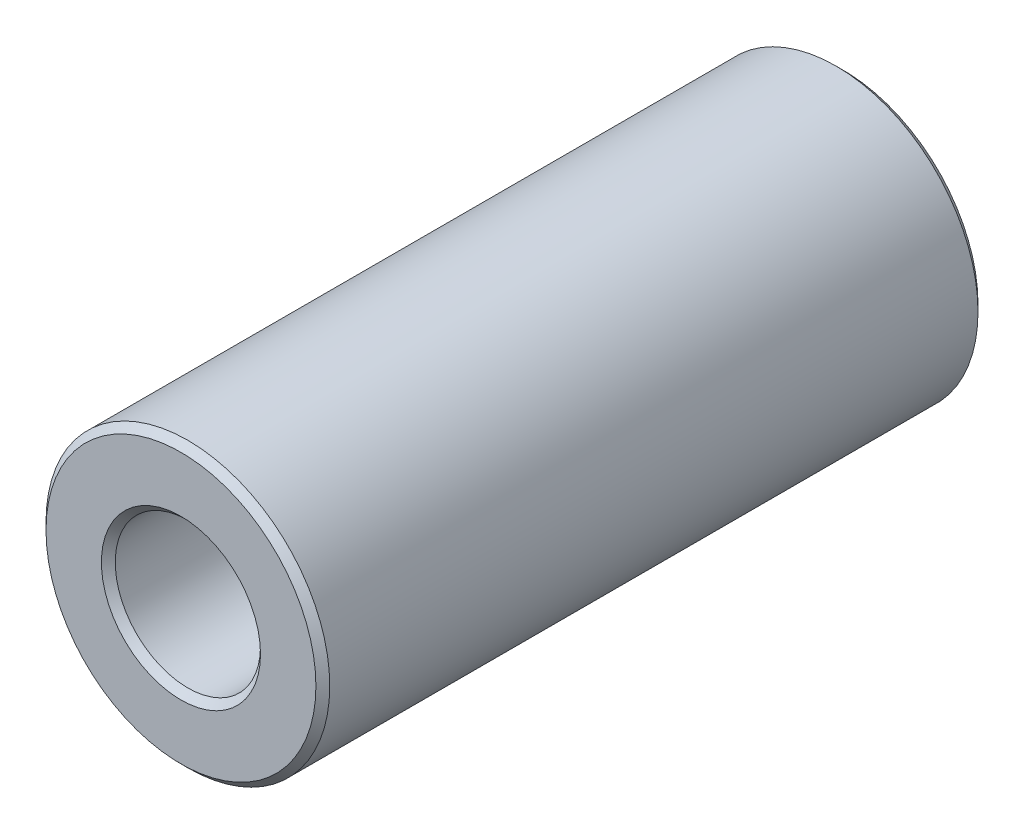
ISO-10303-21;
HEADER;
FILE_DESCRIPTION(('STEP AP214'),'2;1');
FILE_NAME('part.step','',(''),(''),'','','');
FILE_SCHEMA(('AUTOMOTIVE_DESIGN { 1 0 10303 214 1 1 1 1 }'));
ENDSEC;
DATA;
#1=APPLICATION_CONTEXT('core data for automotive mechanical design processes');
#2=APPLICATION_PROTOCOL_DEFINITION('international standard','automotive_design',2000,#1);
#3=PRODUCT_CONTEXT('',#1,'mechanical');
#4=PRODUCT('Part','Part','',(#3));
#5=PRODUCT_RELATED_PRODUCT_CATEGORY('part','',(#4));
#6=PRODUCT_DEFINITION_FORMATION('','',#4);
#7=PRODUCT_DEFINITION_CONTEXT('part definition',#1,'design');
#8=PRODUCT_DEFINITION('design','',#6,#7);
#9=PRODUCT_DEFINITION_SHAPE('','',#8);
#10=(LENGTH_UNIT() NAMED_UNIT(*) SI_UNIT(.MILLI.,.METRE.));
#11=(NAMED_UNIT(*) PLANE_ANGLE_UNIT() SI_UNIT($,.RADIAN.));
#12=(NAMED_UNIT(*) SI_UNIT($,.STERADIAN.) SOLID_ANGLE_UNIT());
#13=UNCERTAINTY_MEASURE_WITH_UNIT(LENGTH_MEASURE(1.E-05),#10,'distance_accuracy_value','');
#14=(GEOMETRIC_REPRESENTATION_CONTEXT(3) GLOBAL_UNCERTAINTY_ASSIGNED_CONTEXT((#13)) GLOBAL_UNIT_ASSIGNED_CONTEXT((#10,
#11,#12)) REPRESENTATION_CONTEXT('',''));
#15=CARTESIAN_POINT('',(0.,0.,0.));
#16=DIRECTION('',(0.,0.,1.));
#17=DIRECTION('',(1.,0.,0.));
#18=AXIS2_PLACEMENT_3D('',#15,#16,#17);
#19=CARTESIAN_POINT('',(0.,0.,-11.1125));
#20=DIRECTION('',(0.,0.,1.));
#21=DIRECTION('',(1.,0.,0.));
#22=AXIS2_PLACEMENT_3D('',#19,#20,#21);
#23=CYLINDRICAL_SURFACE('',#22,4.7625);
#24=CARTESIAN_POINT('',(0.,0.,10.88009));
#25=DIRECTION('',(0.,0.,1.));
#26=DIRECTION('',(1.,0.,0.));
#27=AXIS2_PLACEMENT_3D('',#24,#25,#26);
#28=CIRCLE('',#27,4.7625);
#29=CARTESIAN_POINT('',(-4.7625,0.,10.88009));
#30=VERTEX_POINT('',#29);
#31=EDGE_CURVE('E76',#30,#30,#28,.F.);
#32=ORIENTED_EDGE('',*,*,#31,.T.);
#33=EDGE_LOOP('',(#32));
#34=FACE_BOUND('',#33,.T.);
#35=CARTESIAN_POINT('',(0.,0.,-10.88009));
#36=DIRECTION('',(0.,0.,1.));
#37=DIRECTION('',(1.,0.,0.));
#38=AXIS2_PLACEMENT_3D('',#35,#36,#37);
#39=CIRCLE('',#38,4.7625);
#40=CARTESIAN_POINT('',(4.7625,0.,-10.88009));
#41=VERTEX_POINT('',#40);
#42=EDGE_CURVE('E80',#41,#41,#39,.T.);
#43=ORIENTED_EDGE('',*,*,#42,.T.);
#44=EDGE_LOOP('',(#43));
#45=FACE_BOUND('',#44,.T.);
#46=ADVANCED_FACE('F48',(#34,#45),#23,.T.);
#47=CARTESIAN_POINT('',(0.,0.,-11.1125));
#48=DIRECTION('',(0.,0.,1.));
#49=DIRECTION('',(1.,0.,0.));
#50=AXIS2_PLACEMENT_3D('',#47,#48,#49);
#51=PLANE('',#50);
#52=CARTESIAN_POINT('',(0.,0.,-11.1125));
#53=DIRECTION('',(0.,0.,1.));
#54=DIRECTION('',(1.,0.,0.));
#55=AXIS2_PLACEMENT_3D('',#52,#53,#54);
#56=CIRCLE('',#55,4.53009000000001);
#57=CARTESIAN_POINT('',(4.53009000000001,0.,-11.1125));
#58=VERTEX_POINT('',#57);
#59=EDGE_CURVE('E63',#58,#58,#56,.F.);
#60=ORIENTED_EDGE('',*,*,#59,.T.);
#61=EDGE_LOOP('',(#60));
#62=FACE_BOUND('',#61,.T.);
#63=CARTESIAN_POINT('',(0.,0.,-11.1125));
#64=DIRECTION('',(0.,0.,1.));
#65=DIRECTION('',(1.,0.,0.));
#66=AXIS2_PLACEMENT_3D('',#63,#64,#65);
#67=CIRCLE('',#66,2.67081);
#68=CARTESIAN_POINT('',(2.67081,0.,-11.1125));
#69=VERTEX_POINT('',#68);
#70=EDGE_CURVE('E69',#69,#69,#67,.T.);
#71=ORIENTED_EDGE('',*,*,#70,.T.);
#72=EDGE_LOOP('',(#71));
#73=FACE_BOUND('',#72,.T.);
#74=ADVANCED_FACE('F107',(#62,#73),#51,.F.);
#75=CARTESIAN_POINT('',(0.,0.,-11.1125));
#76=DIRECTION('',(0.,0.,1.));
#77=DIRECTION('',(1.,0.,0.));
#78=AXIS2_PLACEMENT_3D('',#75,#76,#77);
#79=CYLINDRICAL_SURFACE('',#78,2.4384);
#80=CARTESIAN_POINT('',(0.,0.,10.88009));
#81=DIRECTION('',(0.,0.,1.));
#82=DIRECTION('',(1.,0.,0.));
#83=AXIS2_PLACEMENT_3D('',#80,#81,#82);
#84=CIRCLE('',#83,2.4384);
#85=CARTESIAN_POINT('',(2.4384,0.,10.88009));
#86=VERTEX_POINT('',#85);
#87=EDGE_CURVE('E11',#86,#86,#84,.T.);
#88=CARTESIAN_POINT('',(0.,0.,-10.88009));
#89=DIRECTION('',(0.,0.,1.));
#90=DIRECTION('',(1.,0.,0.));
#91=AXIS2_PLACEMENT_3D('',#88,#89,#90);
#92=CIRCLE('',#91,2.4384);
#93=CARTESIAN_POINT('',(2.4384,0.,-10.88009));
#94=VERTEX_POINT('',#93);
#95=EDGE_CURVE('E56',#94,#94,#92,.F.);
#96=CARTESIAN_POINT('',(2.4384,0.,10.88009));
#97=CARTESIAN_POINT('',(2.4384,0.,10.6534214583333));
#98=CARTESIAN_POINT('',(2.4384,0.,10.4267529166667));
#99=CARTESIAN_POINT('',(2.4384,0.,9.97341583333333));
#100=CARTESIAN_POINT('',(2.4384,0.,9.74674729166667));
#101=CARTESIAN_POINT('',(2.4384,0.,9.29341020833333));
#102=CARTESIAN_POINT('',(2.4384,0.,9.06674166666667));
#103=CARTESIAN_POINT('',(2.4384,0.,8.61340458333333));
#104=CARTESIAN_POINT('',(2.4384,0.,8.38673604166667));
#105=CARTESIAN_POINT('',(2.4384,0.,7.93339895833333));
#106=CARTESIAN_POINT('',(2.4384,0.,7.70673041666667));
#107=CARTESIAN_POINT('',(2.4384,0.,7.25339333333333));
#108=CARTESIAN_POINT('',(2.4384,0.,7.02672479166667));
#109=CARTESIAN_POINT('',(2.4384,0.,6.57338770833333));
#110=CARTESIAN_POINT('',(2.4384,0.,6.34671916666667));
#111=CARTESIAN_POINT('',(2.4384,0.,5.89338208333333));
#112=CARTESIAN_POINT('',(2.4384,0.,5.66671354166667));
#113=CARTESIAN_POINT('',(2.4384,0.,5.21337645833333));
#114=CARTESIAN_POINT('',(2.4384,0.,4.98670791666667));
#115=CARTESIAN_POINT('',(2.4384,0.,4.53337083333333));
#116=CARTESIAN_POINT('',(2.4384,0.,4.30670229166667));
#117=CARTESIAN_POINT('',(2.4384,0.,3.85336520833333));
#118=CARTESIAN_POINT('',(2.4384,0.,3.62669666666667));
#119=CARTESIAN_POINT('',(2.4384,0.,3.17335958333333));
#120=CARTESIAN_POINT('',(2.4384,0.,2.94669104166667));
#121=CARTESIAN_POINT('',(2.4384,0.,2.49335395833333));
#122=CARTESIAN_POINT('',(2.4384,0.,2.26668541666667));
#123=CARTESIAN_POINT('',(2.4384,0.,1.81334833333333));
#124=CARTESIAN_POINT('',(2.4384,0.,1.58667979166667));
#125=CARTESIAN_POINT('',(2.4384,0.,1.13334270833333));
#126=CARTESIAN_POINT('',(2.4384,0.,0.906674166666667));
#127=CARTESIAN_POINT('',(2.4384,0.,0.453337083333334));
#128=CARTESIAN_POINT('',(2.4384,0.,0.226668541666667));
#129=CARTESIAN_POINT('',(2.4384,0.,-0.226668541666667));
#130=CARTESIAN_POINT('',(2.4384,0.,-0.453337083333334));
#131=CARTESIAN_POINT('',(2.4384,0.,-0.906674166666667));
#132=CARTESIAN_POINT('',(2.4384,0.,-1.13334270833333));
#133=CARTESIAN_POINT('',(2.4384,0.,-1.58667979166667));
#134=CARTESIAN_POINT('',(2.4384,0.,-1.81334833333333));
#135=CARTESIAN_POINT('',(2.4384,0.,-2.26668541666667));
#136=CARTESIAN_POINT('',(2.4384,0.,-2.49335395833333));
#137=CARTESIAN_POINT('',(2.4384,0.,-2.94669104166667));
#138=CARTESIAN_POINT('',(2.4384,0.,-3.17335958333333));
#139=CARTESIAN_POINT('',(2.4384,0.,-3.62669666666667));
#140=CARTESIAN_POINT('',(2.4384,0.,-3.85336520833333));
#141=CARTESIAN_POINT('',(2.4384,0.,-4.30670229166667));
#142=CARTESIAN_POINT('',(2.4384,0.,-4.53337083333333));
#143=CARTESIAN_POINT('',(2.4384,0.,-4.98670791666667));
#144=CARTESIAN_POINT('',(2.4384,0.,-5.21337645833333));
#145=CARTESIAN_POINT('',(2.4384,0.,-5.66671354166667));
#146=CARTESIAN_POINT('',(2.4384,0.,-5.89338208333333));
#147=CARTESIAN_POINT('',(2.4384,0.,-6.34671916666667));
#148=CARTESIAN_POINT('',(2.4384,0.,-6.57338770833333));
#149=CARTESIAN_POINT('',(2.4384,0.,-7.02672479166667));
#150=CARTESIAN_POINT('',(2.4384,0.,-7.25339333333333));
#151=CARTESIAN_POINT('',(2.4384,0.,-7.70673041666667));
#152=CARTESIAN_POINT('',(2.4384,0.,-7.93339895833333));
#153=CARTESIAN_POINT('',(2.4384,0.,-8.38673604166667));
#154=CARTESIAN_POINT('',(2.4384,0.,-8.61340458333333));
#155=CARTESIAN_POINT('',(2.4384,0.,-9.06674166666667));
#156=CARTESIAN_POINT('',(2.4384,0.,-9.29341020833333));
#157=CARTESIAN_POINT('',(2.4384,0.,-9.74674729166667));
#158=CARTESIAN_POINT('',(2.4384,0.,-9.97341583333333));
#159=CARTESIAN_POINT('',(2.4384,0.,-10.4267529166667));
#160=CARTESIAN_POINT('',(2.4384,0.,-10.6534214583333));
#161=CARTESIAN_POINT('',(2.4384,0.,-10.88009));
#162=B_SPLINE_CURVE_WITH_KNOTS('',3,(#96,#97,#98,#99,#100,#101,#102,#103,#104,#105,#106,#107,
#108,#109,#110,#111,#112,#113,#114,#115,#116,#117,#118,#119,#120,#121,#122,#123,#124,#125,#126,
#127,#128,#129,#130,#131,#132,#133,#134,#135,#136,#137,#138,#139,#140,#141,#142,#143,#144,#145,
#146,#147,#148,#149,#150,#151,#152,#153,#154,#155,#156,#157,#158,#159,#160,#161),.UNSPECIFIED.,
.F.,.F.,(4,2,2,2,2,2,2,2,2,2,2,2,2,2,2,2,2,2,2,2,2,2,2,2,2,2,2,2,2,2,2,2,4),(0.,
0.680005625000001,1.36001125,2.040016875,2.7200225,3.400028125,4.08003375,4.760039375,5.440045,
6.120050625,6.80005625,7.480061875,8.1600675,8.840073125,9.52007875,10.200084375,10.88009,
11.560095625,12.24010125,12.920106875,13.6001125,14.280118125,14.96012375,15.640129375,
16.320135,17.000140625,17.68014625,18.360151875,19.0401575,19.720163125,20.40016875,
21.080174375,21.76018),.UNSPECIFIED.);
#163=EDGE_CURVE('BSEAM114',#86,#94,#162,.T.);
#164=ORIENTED_EDGE('',*,*,#87,.T.);
#165=ORIENTED_EDGE('',*,*,#95,.T.);
#166=ORIENTED_EDGE('',*,*,#163,.T.);
#167=ORIENTED_EDGE('',*,*,#163,.F.);
#168=EDGE_LOOP('',(#164,#166,#165,#167));
#169=FACE_BOUND('',#168,.T.);
#170=ADVANCED_FACE('F114',(#169),#79,.F.);
#171=CARTESIAN_POINT('',(0.,0.,11.1125));
#172=DIRECTION('',(0.,0.,1.));
#173=DIRECTION('',(1.,0.,0.));
#174=AXIS2_PLACEMENT_3D('',#171,#172,#173);
#175=PLANE('',#174);
#176=CARTESIAN_POINT('',(0.,0.,11.1125));
#177=DIRECTION('',(0.,0.,1.));
#178=DIRECTION('',(1.,0.,0.));
#179=AXIS2_PLACEMENT_3D('',#176,#177,#178);
#180=CIRCLE('',#179,4.53009);
#181=CARTESIAN_POINT('',(-4.53009,0.,11.1125));
#182=VERTEX_POINT('',#181);
#183=EDGE_CURVE('E82',#182,#182,#180,.T.);
#184=ORIENTED_EDGE('',*,*,#183,.T.);
#185=EDGE_LOOP('',(#184));
#186=FACE_BOUND('',#185,.T.);
#187=CARTESIAN_POINT('',(0.,0.,11.1125));
#188=DIRECTION('',(0.,0.,1.));
#189=DIRECTION('',(1.,0.,0.));
#190=AXIS2_PLACEMENT_3D('',#187,#188,#189);
#191=CIRCLE('',#190,2.67081);
#192=CARTESIAN_POINT('',(2.67081,0.,11.1125));
#193=VERTEX_POINT('',#192);
#194=EDGE_CURVE('E87',#193,#193,#191,.F.);
#195=ORIENTED_EDGE('',*,*,#194,.T.);
#196=EDGE_LOOP('',(#195));
#197=FACE_BOUND('',#196,.T.);
#198=ADVANCED_FACE('F92',(#186,#197),#175,.T.);
#199=CARTESIAN_POINT('',(0.,0.,11.1125));
#200=DIRECTION('',(0.,0.,-1.));
#201=DIRECTION('',(-1.,0.,0.));
#202=AXIS2_PLACEMENT_3D('',#199,#200,#201);
#203=CONICAL_SURFACE('',#202,4.53009,0.78539816339745);
#204=CARTESIAN_POINT('',(-4.7625,0.,10.88009));
#205=CARTESIAN_POINT('',(-4.7600790625,0.,10.8825109375));
#206=CARTESIAN_POINT('',(-4.757658125,0.,10.884931875));
#207=CARTESIAN_POINT('',(-4.75281625,0.,10.88977375));
#208=CARTESIAN_POINT('',(-4.7503953125,0.,10.8921946875));
#209=CARTESIAN_POINT('',(-4.7455534375,0.,10.8970365625));
#210=CARTESIAN_POINT('',(-4.7431325,0.,10.8994575));
#211=CARTESIAN_POINT('',(-4.738290625,0.,10.904299375));
#212=CARTESIAN_POINT('',(-4.7358696875,0.,10.9067203125));
#213=CARTESIAN_POINT('',(-4.7310278125,0.,10.9115621875));
#214=CARTESIAN_POINT('',(-4.728606875,0.,10.913983125));
#215=CARTESIAN_POINT('',(-4.723765,0.,10.918825));
#216=CARTESIAN_POINT('',(-4.7213440625,0.,10.9212459375));
#217=CARTESIAN_POINT('',(-4.7165021875,0.,10.9260878125));
#218=CARTESIAN_POINT('',(-4.71408125,0.,10.92850875));
#219=CARTESIAN_POINT('',(-4.709239375,0.,10.933350625));
#220=CARTESIAN_POINT('',(-4.7068184375,0.,10.9357715625));
#221=CARTESIAN_POINT('',(-4.7019765625,0.,10.9406134375));
#222=CARTESIAN_POINT('',(-4.699555625,0.,10.943034375));
#223=CARTESIAN_POINT('',(-4.69471375,0.,10.94787625));
#224=CARTESIAN_POINT('',(-4.6922928125,0.,10.9502971875));
#225=CARTESIAN_POINT('',(-4.6874509375,0.,10.9551390625));
#226=CARTESIAN_POINT('',(-4.68503,0.,10.95756));
#227=CARTESIAN_POINT('',(-4.680188125,0.,10.962401875));
#228=CARTESIAN_POINT('',(-4.6777671875,0.,10.9648228125));
#229=CARTESIAN_POINT('',(-4.6729253125,0.,10.9696646875));
#230=CARTESIAN_POINT('',(-4.670504375,0.,10.972085625));
#231=CARTESIAN_POINT('',(-4.6656625,0.,10.9769275));
#232=CARTESIAN_POINT('',(-4.6632415625,0.,10.9793484375));
#233=CARTESIAN_POINT('',(-4.6583996875,0.,10.9841903125));
#234=CARTESIAN_POINT('',(-4.65597875,0.,10.98661125));
#235=CARTESIAN_POINT('',(-4.651136875,0.,10.991453125));
#236=CARTESIAN_POINT('',(-4.6487159375,0.,10.9938740625));
#237=CARTESIAN_POINT('',(-4.6438740625,0.,10.9987159375));
#238=CARTESIAN_POINT('',(-4.641453125,0.,11.001136875));
#239=CARTESIAN_POINT('',(-4.63661125,0.,11.00597875));
#240=CARTESIAN_POINT('',(-4.6341903125,0.,11.0083996875));
#241=CARTESIAN_POINT('',(-4.6293484375,0.,11.0132415625));
#242=CARTESIAN_POINT('',(-4.6269275,0.,11.0156625));
#243=CARTESIAN_POINT('',(-4.622085625,0.,11.020504375));
#244=CARTESIAN_POINT('',(-4.6196646875,0.,11.0229253125));
#245=CARTESIAN_POINT('',(-4.6148228125,0.,11.0277671875));
#246=CARTESIAN_POINT('',(-4.612401875,0.,11.030188125));
#247=CARTESIAN_POINT('',(-4.60756,0.,11.03503));
#248=CARTESIAN_POINT('',(-4.6051390625,0.,11.0374509375));
#249=CARTESIAN_POINT('',(-4.6002971875,0.,11.0422928125));
#250=CARTESIAN_POINT('',(-4.59787625,0.,11.04471375));
#251=CARTESIAN_POINT('',(-4.593034375,0.,11.049555625));
#252=CARTESIAN_POINT('',(-4.5906134375,0.,11.0519765625));
#253=CARTESIAN_POINT('',(-4.5857715625,0.,11.0568184375));
#254=CARTESIAN_POINT('',(-4.583350625,0.,11.059239375));
#255=CARTESIAN_POINT('',(-4.57850875,0.,11.06408125));
#256=CARTESIAN_POINT('',(-4.5760878125,0.,11.0665021875));
#257=CARTESIAN_POINT('',(-4.5712459375,0.,11.0713440625));
#258=CARTESIAN_POINT('',(-4.568825,0.,11.073765));
#259=CARTESIAN_POINT('',(-4.563983125,0.,11.078606875));
#260=CARTESIAN_POINT('',(-4.5615621875,0.,11.0810278125));
#261=CARTESIAN_POINT('',(-4.5567203125,0.,11.0858696875));
#262=CARTESIAN_POINT('',(-4.554299375,0.,11.088290625));
#263=CARTESIAN_POINT('',(-4.5494575,0.,11.0931325));
#264=CARTESIAN_POINT('',(-4.5470365625,0.,11.0955534375));
#265=CARTESIAN_POINT('',(-4.5421946875,0.,11.1003953125));
#266=CARTESIAN_POINT('',(-4.53977375,0.,11.10281625));
#267=CARTESIAN_POINT('',(-4.534931875,0.,11.107658125));
#268=CARTESIAN_POINT('',(-4.5325109375,0.,11.1100790625));
#269=CARTESIAN_POINT('',(-4.53009,0.,11.1125));
#270=B_SPLINE_CURVE_WITH_KNOTS('',3,(#204,#205,#206,#207,#208,#209,#210,#211,#212,#213,#214,
#215,#216,#217,#218,#219,#220,#221,#222,#223,#224,#225,#226,#227,#228,#229,#230,#231,#232,#233,
#234,#235,#236,#237,#238,#239,#240,#241,#242,#243,#244,#245,#246,#247,#248,#249,#250,#251,#252,
#253,#254,#255,#256,#257,#258,#259,#260,#261,#262,#263,#264,#265,#266,#267,#268,#269),
.UNSPECIFIED.,.F.,.F.,(4,2,2,2,2,2,2,2,2,2,2,2,2,2,2,2,2,2,2,2,2,2,2,2,2,2,2,2,2,2,2,2,4),(0.,
0.0102711679384717,0.0205423358769453,0.0308135038154182,0.0410846717538906,0.0513558396923635,
0.0616270076308365,0.0718981755693088,0.0821693435077817,0.0924405114462553,0.102711679384727,
0.1129828473232,0.123254015261674,0.133525183200145,0.143796351138619,0.154067519077092,
0.164338687015565,0.174609854954037,0.18488102289251,0.195152190830984,0.205423358769455,
0.215694526707929,0.225965694646402,0.236236862584874,0.246508030523347,0.25677919846182,
0.267050366400292,0.277321534338765,0.287592702277238,0.297863870215711,0.308135038154183,
0.318406206092657,0.32867737403113),.UNSPECIFIED.);
#271=EDGE_CURVE('BSEAM103',#30,#182,#270,.T.);
#272=ORIENTED_EDGE('',*,*,#31,.F.);
#273=ORIENTED_EDGE('',*,*,#183,.F.);
#274=ORIENTED_EDGE('',*,*,#271,.T.);
#275=ORIENTED_EDGE('',*,*,#271,.F.);
#276=EDGE_LOOP('',(#272,#274,#273,#275));
#277=FACE_BOUND('',#276,.T.);
#278=ADVANCED_FACE('F103',(#277),#203,.T.);
#279=CARTESIAN_POINT('',(0.,0.,-10.88009));
#280=DIRECTION('',(0.,0.,1.));
#281=DIRECTION('',(1.,0.,0.));
#282=AXIS2_PLACEMENT_3D('',#279,#280,#281);
#283=CONICAL_SURFACE('',#282,4.7625,0.785398163397446);
#284=ORIENTED_EDGE('',*,*,#59,.F.);
#285=EDGE_LOOP('',(#284));
#286=FACE_BOUND('',#285,.T.);
#287=ORIENTED_EDGE('',*,*,#42,.F.);
#288=EDGE_LOOP('',(#287));
#289=FACE_BOUND('',#288,.T.);
#290=ADVANCED_FACE('F97',(#286,#289),#283,.T.);
#291=CARTESIAN_POINT('',(0.,0.,10.88009));
#292=DIRECTION('',(0.,0.,1.));
#293=DIRECTION('',(1.,0.,0.));
#294=AXIS2_PLACEMENT_3D('',#291,#292,#293);
#295=CONICAL_SURFACE('',#294,2.4384,0.785398163397448);
#296=CARTESIAN_POINT('',(2.67081,0.,11.1125));
#297=CARTESIAN_POINT('',(2.6683890625,0.,11.1100790625));
#298=CARTESIAN_POINT('',(2.665968125,0.,11.107658125));
#299=CARTESIAN_POINT('',(2.66112625,0.,11.10281625));
#300=CARTESIAN_POINT('',(2.6587053125,0.,11.1003953125));
#301=CARTESIAN_POINT('',(2.6538634375,0.,11.0955534375));
#302=CARTESIAN_POINT('',(2.6514425,0.,11.0931325));
#303=CARTESIAN_POINT('',(2.646600625,0.,11.088290625));
#304=CARTESIAN_POINT('',(2.6441796875,0.,11.0858696875));
#305=CARTESIAN_POINT('',(2.6393378125,0.,11.0810278125));
#306=CARTESIAN_POINT('',(2.636916875,0.,11.078606875));
#307=CARTESIAN_POINT('',(2.632075,0.,11.073765));
#308=CARTESIAN_POINT('',(2.6296540625,0.,11.0713440625));
#309=CARTESIAN_POINT('',(2.6248121875,0.,11.0665021875));
#310=CARTESIAN_POINT('',(2.62239125,0.,11.06408125));
#311=CARTESIAN_POINT('',(2.617549375,0.,11.059239375));
#312=CARTESIAN_POINT('',(2.6151284375,0.,11.0568184375));
#313=CARTESIAN_POINT('',(2.6102865625,0.,11.0519765625));
#314=CARTESIAN_POINT('',(2.607865625,0.,11.049555625));
#315=CARTESIAN_POINT('',(2.60302375,0.,11.04471375));
#316=CARTESIAN_POINT('',(2.6006028125,0.,11.0422928125));
#317=CARTESIAN_POINT('',(2.5957609375,0.,11.0374509375));
#318=CARTESIAN_POINT('',(2.59334,0.,11.03503));
#319=CARTESIAN_POINT('',(2.588498125,0.,11.030188125));
#320=CARTESIAN_POINT('',(2.5860771875,0.,11.0277671875));
#321=CARTESIAN_POINT('',(2.5812353125,0.,11.0229253125));
#322=CARTESIAN_POINT('',(2.578814375,0.,11.020504375));
#323=CARTESIAN_POINT('',(2.5739725,0.,11.0156625));
#324=CARTESIAN_POINT('',(2.5715515625,0.,11.0132415625));
#325=CARTESIAN_POINT('',(2.5667096875,0.,11.0083996875));
#326=CARTESIAN_POINT('',(2.56428875,0.,11.00597875));
#327=CARTESIAN_POINT('',(2.559446875,0.,11.001136875));
#328=CARTESIAN_POINT('',(2.5570259375,0.,10.9987159375));
#329=CARTESIAN_POINT('',(2.5521840625,0.,10.9938740625));
#330=CARTESIAN_POINT('',(2.549763125,0.,10.991453125));
#331=CARTESIAN_POINT('',(2.54492125,0.,10.98661125));
#332=CARTESIAN_POINT('',(2.5425003125,0.,10.9841903125));
#333=CARTESIAN_POINT('',(2.5376584375,0.,10.9793484375));
#334=CARTESIAN_POINT('',(2.5352375,0.,10.9769275));
#335=CARTESIAN_POINT('',(2.530395625,0.,10.972085625));
#336=CARTESIAN_POINT('',(2.5279746875,0.,10.9696646875));
#337=CARTESIAN_POINT('',(2.5231328125,0.,10.9648228125));
#338=CARTESIAN_POINT('',(2.520711875,0.,10.962401875));
#339=CARTESIAN_POINT('',(2.51587,0.,10.95756));
#340=CARTESIAN_POINT('',(2.5134490625,0.,10.9551390625));
#341=CARTESIAN_POINT('',(2.5086071875,0.,10.9502971875));
#342=CARTESIAN_POINT('',(2.50618625,0.,10.94787625));
#343=CARTESIAN_POINT('',(2.501344375,0.,10.943034375));
#344=CARTESIAN_POINT('',(2.4989234375,0.,10.9406134375));
#345=CARTESIAN_POINT('',(2.4940815625,0.,10.9357715625));
#346=CARTESIAN_POINT('',(2.491660625,0.,10.933350625));
#347=CARTESIAN_POINT('',(2.48681875,0.,10.92850875));
#348=CARTESIAN_POINT('',(2.4843978125,0.,10.9260878125));
#349=CARTESIAN_POINT('',(2.4795559375,0.,10.9212459375));
#350=CARTESIAN_POINT('',(2.477135,0.,10.918825));
#351=CARTESIAN_POINT('',(2.472293125,0.,10.913983125));
#352=CARTESIAN_POINT('',(2.4698721875,0.,10.9115621875));
#353=CARTESIAN_POINT('',(2.4650303125,0.,10.9067203125));
#354=CARTESIAN_POINT('',(2.462609375,0.,10.904299375));
#355=CARTESIAN_POINT('',(2.4577675,0.,10.8994575));
#356=CARTESIAN_POINT('',(2.4553465625,0.,10.8970365625));
#357=CARTESIAN_POINT('',(2.4505046875,0.,10.8921946875));
#358=CARTESIAN_POINT('',(2.44808375,0.,10.88977375));
#359=CARTESIAN_POINT('',(2.443241875,0.,10.884931875));
#360=CARTESIAN_POINT('',(2.4408209375,0.,10.8825109375));
#361=CARTESIAN_POINT('',(2.4384,0.,10.88009));
#362=B_SPLINE_CURVE_WITH_KNOTS('',3,(#296,#297,#298,#299,#300,#301,#302,#303,#304,#305,#306,
#307,#308,#309,#310,#311,#312,#313,#314,#315,#316,#317,#318,#319,#320,#321,#322,#323,#324,#325,
#326,#327,#328,#329,#330,#331,#332,#333,#334,#335,#336,#337,#338,#339,#340,#341,#342,#343,#344,
#345,#346,#347,#348,#349,#350,#351,#352,#353,#354,#355,#356,#357,#358,#359,#360,#361),
.UNSPECIFIED.,.F.,.F.,(4,2,2,2,2,2,2,2,2,2,2,2,2,2,2,2,2,2,2,2,2,2,2,2,2,2,2,2,2,2,2,2,4),(0.,
0.0102711679384733,0.0205423358769462,0.0308135038154195,0.0410846717538915,0.0513558396923647,
0.0616270076308377,0.0718981755693097,0.082169343507783,0.0924405114462562,0.102711679384728,
0.112982847323201,0.123254015261674,0.133525183200147,0.143796351138619,0.154067519077093,
0.164338687015565,0.174609854954038,0.184881022892511,0.195152190830984,0.205423358769456,
0.215694526707929,0.225965694646402,0.236236862584874,0.246508030523348,0.256779198461821,
0.267050366400293,0.277321534338766,0.287592702277239,0.297863870215711,0.308135038154184,
0.318406206092657,0.328677374031129),.UNSPECIFIED.);
#363=EDGE_CURVE('BSEAM94',#193,#86,#362,.T.);
#364=ORIENTED_EDGE('',*,*,#194,.F.);
#365=ORIENTED_EDGE('',*,*,#87,.F.);
#366=ORIENTED_EDGE('',*,*,#363,.T.);
#367=ORIENTED_EDGE('',*,*,#363,.F.);
#368=EDGE_LOOP('',(#364,#366,#365,#367));
#369=FACE_BOUND('',#368,.T.);
#370=ADVANCED_FACE('F94',(#369),#295,.F.);
#371=CARTESIAN_POINT('',(0.,0.,-11.1125));
#372=DIRECTION('',(0.,0.,-1.));
#373=DIRECTION('',(-1.,0.,0.));
#374=AXIS2_PLACEMENT_3D('',#371,#372,#373);
#375=CONICAL_SURFACE('',#374,2.67081,0.785398163397448);
#376=ORIENTED_EDGE('',*,*,#95,.F.);
#377=EDGE_LOOP('',(#376));
#378=FACE_BOUND('',#377,.T.);
#379=ORIENTED_EDGE('',*,*,#70,.F.);
#380=EDGE_LOOP('',(#379));
#381=FACE_BOUND('',#380,.T.);
#382=ADVANCED_FACE('F50',(#378,#381),#375,.F.);
#383=CLOSED_SHELL('',(#46,#74,#170,#198,#278,#290,#370,#382));
#384=MANIFOLD_SOLID_BREP('B2',#383);
#385=ADVANCED_BREP_SHAPE_REPRESENTATION('',(#18,#384),#14);
#386=SHAPE_DEFINITION_REPRESENTATION(#9,#385);
ENDSEC;
END-ISO-10303-21;
